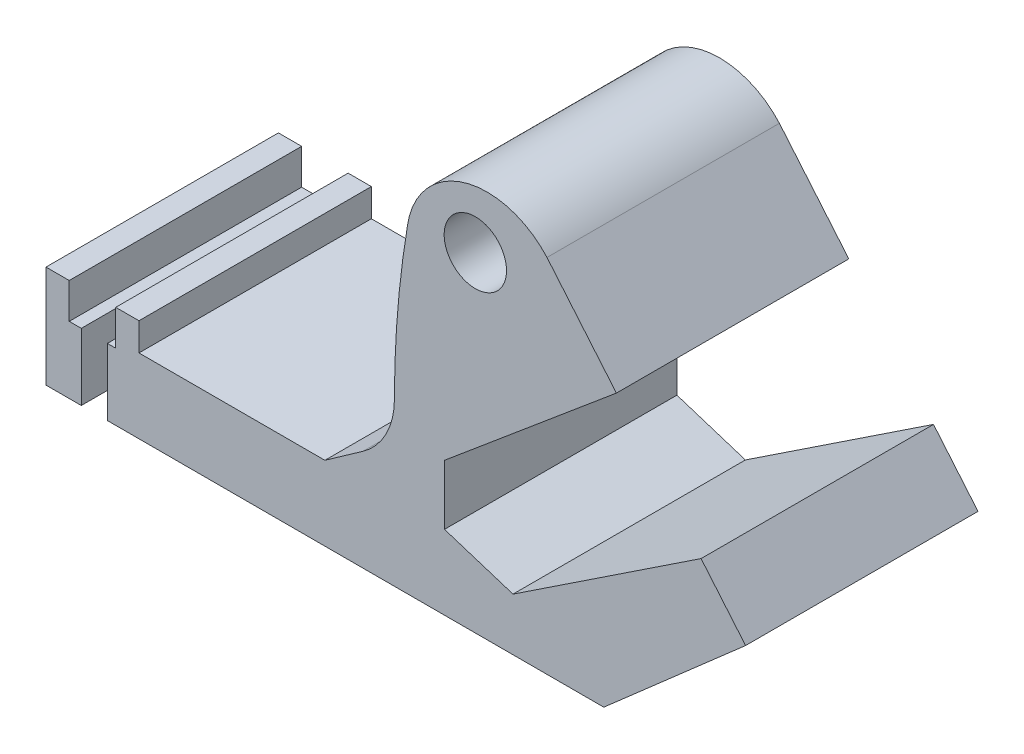
ISO-10303-21;
HEADER;
FILE_DESCRIPTION(('STEP AP214'),'2;1');
FILE_NAME('part.step','',(''),(''),'','','');
FILE_SCHEMA(('AUTOMOTIVE_DESIGN { 1 0 10303 214 1 1 1 1 }'));
ENDSEC;
DATA;
#1=APPLICATION_CONTEXT('core data for automotive mechanical design processes');
#2=APPLICATION_PROTOCOL_DEFINITION('international standard','automotive_design',2000,#1);
#3=PRODUCT_CONTEXT('',#1,'mechanical');
#4=PRODUCT('Part','Part','',(#3));
#5=PRODUCT_RELATED_PRODUCT_CATEGORY('part','',(#4));
#6=PRODUCT_DEFINITION_FORMATION('','',#4);
#7=PRODUCT_DEFINITION_CONTEXT('part definition',#1,'design');
#8=PRODUCT_DEFINITION('design','',#6,#7);
#9=PRODUCT_DEFINITION_SHAPE('','',#8);
#10=(LENGTH_UNIT() NAMED_UNIT(*) SI_UNIT(.MILLI.,.METRE.));
#11=(NAMED_UNIT(*) PLANE_ANGLE_UNIT() SI_UNIT($,.RADIAN.));
#12=(NAMED_UNIT(*) SI_UNIT($,.STERADIAN.) SOLID_ANGLE_UNIT());
#13=UNCERTAINTY_MEASURE_WITH_UNIT(LENGTH_MEASURE(1.E-05),#10,'distance_accuracy_value','');
#14=(GEOMETRIC_REPRESENTATION_CONTEXT(3) GLOBAL_UNCERTAINTY_ASSIGNED_CONTEXT((#13)) GLOBAL_UNIT_ASSIGNED_CONTEXT((#10,
#11,#12)) REPRESENTATION_CONTEXT('',''));
#15=CARTESIAN_POINT('',(0.,0.,0.));
#16=DIRECTION('',(0.,0.,1.));
#17=DIRECTION('',(1.,0.,0.));
#18=AXIS2_PLACEMENT_3D('',#15,#16,#17);
#19=CARTESIAN_POINT('',(0.,14.3835616438356,50.));
#20=DIRECTION('',(0.,1.,0.));
#21=DIRECTION('',(0.,0.,1.));
#22=AXIS2_PLACEMENT_3D('',#19,#20,#21);
#23=PLANE('',#22);
#24=DIRECTION('',(0.,0.,1.));
#25=VECTOR('',#24,1.);
#26=CARTESIAN_POINT('',(-72.5423341715558,14.3835616438356,0.));
#27=LINE('',#26,#25);
#28=CARTESIAN_POINT('',(-72.5423341715558,14.3835616438356,0.));
#29=VERTEX_POINT('',#28);
#30=CARTESIAN_POINT('',(-72.5423341715558,14.3835616438356,50.));
#31=VERTEX_POINT('',#30);
#32=EDGE_CURVE('E54',#29,#31,#27,.T.);
#33=ORIENTED_EDGE('',*,*,#32,.F.);
#34=DIRECTION('',(1.,0.,0.));
#35=VECTOR('',#34,1.);
#36=CARTESIAN_POINT('',(0.,14.3835616438356,0.));
#37=LINE('',#36,#35);
#38=CARTESIAN_POINT('',(-75.1369863013698,14.3835616438356,0.));
#39=VERTEX_POINT('',#38);
#40=EDGE_CURVE('E48',#39,#29,#37,.T.);
#41=ORIENTED_EDGE('',*,*,#40,.F.);
#42=DIRECTION('',(0.,0.,-1.));
#43=VECTOR('',#42,1.);
#44=CARTESIAN_POINT('',(-75.1369863013698,14.3835616438356,50.));
#45=LINE('',#44,#43);
#46=CARTESIAN_POINT('',(-75.1369863013698,14.3835616438356,50.));
#47=VERTEX_POINT('',#46);
#48=EDGE_CURVE('E129',#47,#39,#45,.T.);
#49=ORIENTED_EDGE('',*,*,#48,.F.);
#50=DIRECTION('',(1.,0.,0.));
#51=VECTOR('',#50,1.);
#52=CARTESIAN_POINT('',(0.,14.3835616438356,50.));
#53=LINE('',#52,#51);
#54=EDGE_CURVE('E106',#47,#31,#53,.T.);
#55=ORIENTED_EDGE('',*,*,#54,.T.);
#56=EDGE_LOOP('',(#33,#41,#49,#55));
#57=FACE_BOUND('',#56,.T.);
#58=ADVANCED_FACE('F45',(#57),#23,.T.);
#59=CARTESIAN_POINT('',(0.,0.,50.));
#60=DIRECTION('',(0.,1.,0.));
#61=DIRECTION('',(0.,0.,1.));
#62=AXIS2_PLACEMENT_3D('',#59,#60,#61);
#63=PLANE('',#62);
#64=DIRECTION('',(1.,0.,0.));
#65=VECTOR('',#64,1.);
#66=CARTESIAN_POINT('',(0.,0.,0.));
#67=LINE('',#66,#65);
#68=CARTESIAN_POINT('',(-80.1369863013699,0.,0.));
#69=VERTEX_POINT('',#68);
#70=CARTESIAN_POINT('',(-72.5423341715558,0.,0.));
#71=VERTEX_POINT('',#70);
#72=EDGE_CURVE('E122',#69,#71,#67,.T.);
#73=ORIENTED_EDGE('',*,*,#72,.T.);
#74=DIRECTION('',(0.,0.,1.));
#75=VECTOR('',#74,1.);
#76=CARTESIAN_POINT('',(-72.5423341715558,0.,50.));
#77=LINE('',#76,#75);
#78=CARTESIAN_POINT('',(-72.5423341715558,0.,50.));
#79=VERTEX_POINT('',#78);
#80=EDGE_CURVE('E62',#71,#79,#77,.T.);
#81=ORIENTED_EDGE('',*,*,#80,.T.);
#82=DIRECTION('',(1.,0.,0.));
#83=VECTOR('',#82,1.);
#84=CARTESIAN_POINT('',(0.,0.,50.));
#85=LINE('',#84,#83);
#86=CARTESIAN_POINT('',(-80.1369863013699,0.,50.));
#87=VERTEX_POINT('',#86);
#88=EDGE_CURVE('E113',#87,#79,#85,.T.);
#89=ORIENTED_EDGE('',*,*,#88,.F.);
#90=DIRECTION('',(0.,0.,-1.));
#91=VECTOR('',#90,1.);
#92=CARTESIAN_POINT('',(-80.1369863013699,0.,50.));
#93=LINE('',#92,#91);
#94=EDGE_CURVE('E115',#87,#69,#93,.T.);
#95=ORIENTED_EDGE('',*,*,#94,.T.);
#96=EDGE_LOOP('',(#73,#81,#89,#95));
#97=FACE_BOUND('',#96,.T.);
#98=ADVANCED_FACE('F155',(#97),#63,.F.);
#99=CARTESIAN_POINT('',(0.,0.,50.));
#100=DIRECTION('',(0.,0.,1.));
#101=DIRECTION('',(1.,0.,0.));
#102=AXIS2_PLACEMENT_3D('',#99,#100,#101);
#103=PLANE('',#102);
#104=DIRECTION('',(0.,-1.,0.));
#105=VECTOR('',#104,1.);
#106=CARTESIAN_POINT('',(-72.5423341715558,14.3835616438356,50.));
#107=LINE('',#106,#105);
#108=EDGE_CURVE('E12',#31,#79,#107,.T.);
#109=ORIENTED_EDGE('',*,*,#108,.F.);
#110=ORIENTED_EDGE('',*,*,#54,.F.);
#111=DIRECTION('',(0.,-1.,0.));
#112=VECTOR('',#111,1.);
#113=CARTESIAN_POINT('',(-75.1369863013698,-1.36905874327091E-13,50.));
#114=LINE('',#113,#112);
#115=CARTESIAN_POINT('',(-75.1369863013698,22.,50.));
#116=VERTEX_POINT('',#115);
#117=EDGE_CURVE('E126',#116,#47,#114,.T.);
#118=ORIENTED_EDGE('',*,*,#117,.F.);
#119=DIRECTION('',(1.,0.,0.));
#120=VECTOR('',#119,1.);
#121=CARTESIAN_POINT('',(0.,22.,50.));
#122=LINE('',#121,#120);
#123=CARTESIAN_POINT('',(-80.1369863013699,22.,50.));
#124=VERTEX_POINT('',#123);
#125=EDGE_CURVE('E130',#124,#116,#122,.T.);
#126=ORIENTED_EDGE('',*,*,#125,.F.);
#127=DIRECTION('',(0.,1.,0.));
#128=VECTOR('',#127,1.);
#129=CARTESIAN_POINT('',(-80.1369863013699,0.,50.));
#130=LINE('',#129,#128);
#131=EDGE_CURVE('E134',#87,#124,#130,.T.);
#132=ORIENTED_EDGE('',*,*,#131,.F.);
#133=ORIENTED_EDGE('',*,*,#88,.T.);
#134=EDGE_LOOP('',(#109,#110,#118,#126,#132,#133));
#135=FACE_BOUND('',#134,.T.);
#136=ADVANCED_FACE('F147',(#135),#103,.T.);
#137=CARTESIAN_POINT('',(0.,0.,0.));
#138=DIRECTION('',(0.,0.,1.));
#139=DIRECTION('',(1.,0.,0.));
#140=AXIS2_PLACEMENT_3D('',#137,#138,#139);
#141=PLANE('',#140);
#142=ORIENTED_EDGE('',*,*,#40,.T.);
#143=DIRECTION('',(0.,-1.,0.));
#144=VECTOR('',#143,1.);
#145=CARTESIAN_POINT('',(-72.5423341715558,14.3835616438356,0.));
#146=LINE('',#145,#144);
#147=EDGE_CURVE('E93',#29,#71,#146,.T.);
#148=ORIENTED_EDGE('',*,*,#147,.T.);
#149=ORIENTED_EDGE('',*,*,#72,.F.);
#150=DIRECTION('',(0.,1.,0.));
#151=VECTOR('',#150,1.);
#152=CARTESIAN_POINT('',(-80.1369863013699,0.,0.));
#153=LINE('',#152,#151);
#154=CARTESIAN_POINT('',(-80.1369863013699,22.,0.));
#155=VERTEX_POINT('',#154);
#156=EDGE_CURVE('E99',#69,#155,#153,.T.);
#157=ORIENTED_EDGE('',*,*,#156,.T.);
#158=DIRECTION('',(1.,0.,0.));
#159=VECTOR('',#158,1.);
#160=CARTESIAN_POINT('',(0.,22.,0.));
#161=LINE('',#160,#159);
#162=CARTESIAN_POINT('',(-75.1369863013698,22.,0.));
#163=VERTEX_POINT('',#162);
#164=EDGE_CURVE('E138',#155,#163,#161,.T.);
#165=ORIENTED_EDGE('',*,*,#164,.T.);
#166=DIRECTION('',(0.,-1.,0.));
#167=VECTOR('',#166,1.);
#168=CARTESIAN_POINT('',(-75.1369863013698,-1.36905874327091E-13,0.));
#169=LINE('',#168,#167);
#170=EDGE_CURVE('E112',#163,#39,#169,.T.);
#171=ORIENTED_EDGE('',*,*,#170,.T.);
#172=EDGE_LOOP('',(#142,#148,#149,#157,#165,#171));
#173=FACE_BOUND('',#172,.T.);
#174=ADVANCED_FACE('F109',(#173),#141,.F.);
#175=CARTESIAN_POINT('',(-75.1369863013698,-1.36905874327091E-13,50.));
#176=DIRECTION('',(1.,0.,0.));
#177=DIRECTION('',(0.,1.,0.));
#178=AXIS2_PLACEMENT_3D('',#175,#176,#177);
#179=PLANE('',#178);
#180=ORIENTED_EDGE('',*,*,#170,.F.);
#181=DIRECTION('',(0.,0.,-1.));
#182=VECTOR('',#181,1.);
#183=CARTESIAN_POINT('',(-75.1369863013698,22.,50.));
#184=LINE('',#183,#182);
#185=EDGE_CURVE('E133',#116,#163,#184,.T.);
#186=ORIENTED_EDGE('',*,*,#185,.F.);
#187=ORIENTED_EDGE('',*,*,#117,.T.);
#188=ORIENTED_EDGE('',*,*,#48,.T.);
#189=EDGE_LOOP('',(#180,#186,#187,#188));
#190=FACE_BOUND('',#189,.T.);
#191=ADVANCED_FACE('F145',(#190),#179,.T.);
#192=CARTESIAN_POINT('',(0.,22.,50.));
#193=DIRECTION('',(0.,1.,0.));
#194=DIRECTION('',(0.,0.,1.));
#195=AXIS2_PLACEMENT_3D('',#192,#193,#194);
#196=PLANE('',#195);
#197=ORIENTED_EDGE('',*,*,#164,.F.);
#198=DIRECTION('',(0.,0.,-1.));
#199=VECTOR('',#198,1.);
#200=CARTESIAN_POINT('',(-80.1369863013699,22.,50.));
#201=LINE('',#200,#199);
#202=EDGE_CURVE('E107',#124,#155,#201,.T.);
#203=ORIENTED_EDGE('',*,*,#202,.F.);
#204=ORIENTED_EDGE('',*,*,#125,.T.);
#205=ORIENTED_EDGE('',*,*,#185,.T.);
#206=EDGE_LOOP('',(#197,#203,#204,#205));
#207=FACE_BOUND('',#206,.T.);
#208=ADVANCED_FACE('F151',(#207),#196,.T.);
#209=CARTESIAN_POINT('',(-80.1369863013699,0.,50.));
#210=DIRECTION('',(-1.,0.,0.));
#211=DIRECTION('',(0.,0.,1.));
#212=AXIS2_PLACEMENT_3D('',#209,#210,#211);
#213=PLANE('',#212);
#214=ORIENTED_EDGE('',*,*,#156,.F.);
#215=ORIENTED_EDGE('',*,*,#94,.F.);
#216=ORIENTED_EDGE('',*,*,#131,.T.);
#217=ORIENTED_EDGE('',*,*,#202,.T.);
#218=EDGE_LOOP('',(#214,#215,#216,#217));
#219=FACE_BOUND('',#218,.T.);
#220=ADVANCED_FACE('F154',(#219),#213,.T.);
#221=CARTESIAN_POINT('',(-72.5423341715558,14.3835616438356,0.));
#222=DIRECTION('',(-1.,0.,0.));
#223=DIRECTION('',(0.,0.,1.));
#224=AXIS2_PLACEMENT_3D('',#221,#222,#223);
#225=PLANE('',#224);
#226=ORIENTED_EDGE('',*,*,#147,.F.);
#227=ORIENTED_EDGE('',*,*,#32,.T.);
#228=ORIENTED_EDGE('',*,*,#108,.T.);
#229=ORIENTED_EDGE('',*,*,#80,.F.);
#230=EDGE_LOOP('',(#226,#227,#228,#229));
#231=FACE_BOUND('',#230,.T.);
#232=ADVANCED_FACE('F94',(#231),#225,.F.);
#233=CLOSED_SHELL('',(#58,#98,#136,#174,#191,#208,#220,#232));
#234=MANIFOLD_SOLID_BREP('B2',#233);
#235=CARTESIAN_POINT('',(17.3163557590527,-19.7591991249492,50.));
#236=DIRECTION('',(0.659087667466013,-0.752066118499039,0.));
#237=DIRECTION('',(0.752066118499039,0.659087667466013,0.));
#238=AXIS2_PLACEMENT_3D('',#235,#236,#237);
#239=PLANE('',#238);
#240=DIRECTION('',(-0.752066118499039,-0.659087667466013,0.));
#241=VECTOR('',#240,1.);
#242=CARTESIAN_POINT('',(17.3163557590527,-19.7591991249492,0.));
#243=LINE('',#242,#241);
#244=CARTESIAN_POINT('',(70.3687706515894,26.7343092579921,0.));
#245=VERTEX_POINT('',#244);
#246=CARTESIAN_POINT('',(39.8630136986301,0.,0.));
#247=VERTEX_POINT('',#246);
#248=EDGE_CURVE('E404',#245,#247,#243,.T.);
#249=ORIENTED_EDGE('',*,*,#248,.F.);
#250=DIRECTION('',(0.,0.,-1.));
#251=VECTOR('',#250,1.);
#252=CARTESIAN_POINT('',(70.3687706515894,26.7343092579921,50.));
#253=LINE('',#252,#251);
#254=CARTESIAN_POINT('',(70.3687706515894,26.7343092579921,50.));
#255=VERTEX_POINT('',#254);
#256=EDGE_CURVE('E429',#255,#245,#253,.T.);
#257=ORIENTED_EDGE('',*,*,#256,.F.);
#258=DIRECTION('',(-0.752066118499039,-0.659087667466013,0.));
#259=VECTOR('',#258,1.);
#260=CARTESIAN_POINT('',(17.3163557590527,-19.7591991249492,50.));
#261=LINE('',#260,#259);
#262=CARTESIAN_POINT('',(39.8630136986301,0.,50.));
#263=VERTEX_POINT('',#262);
#264=EDGE_CURVE('E490',#255,#263,#261,.T.);
#265=ORIENTED_EDGE('',*,*,#264,.T.);
#266=DIRECTION('',(0.,0.,-1.));
#267=VECTOR('',#266,1.);
#268=CARTESIAN_POINT('',(39.8630136986301,0.,50.));
#269=LINE('',#268,#267);
#270=EDGE_CURVE('E431',#263,#247,#269,.T.);
#271=ORIENTED_EDGE('',*,*,#270,.T.);
#272=EDGE_LOOP('',(#249,#257,#265,#271));
#273=FACE_BOUND('',#272,.T.);
#274=ADVANCED_FACE('F221',(#273),#239,.T.);
#275=CARTESIAN_POINT('',(54.4784531641883,45.6837252991175,50.));
#276=DIRECTION('',(0.766246114652331,0.642547190313838,0.));
#277=DIRECTION('',(-0.642547190313838,0.766246114652331,0.));
#278=AXIS2_PLACEMENT_3D('',#275,#276,#277);
#279=PLANE('',#278);
#280=DIRECTION('',(0.642547190313838,-0.766246114652331,0.));
#281=VECTOR('',#280,1.);
#282=CARTESIAN_POINT('',(54.4784531641883,45.6837252991175,0.));
#283=LINE('',#282,#281);
#284=CARTESIAN_POINT('',(60.7931169667828,38.1534042938845,0.));
#285=VERTEX_POINT('',#284);
#286=EDGE_CURVE('E407',#285,#245,#283,.T.);
#287=ORIENTED_EDGE('',*,*,#286,.F.);
#288=DIRECTION('',(0.,0.,-1.));
#289=VECTOR('',#288,1.);
#290=CARTESIAN_POINT('',(60.7931169667828,38.1534042938845,50.));
#291=LINE('',#290,#289);
#292=CARTESIAN_POINT('',(60.7931169667828,38.1534042938845,50.));
#293=VERTEX_POINT('',#292);
#294=EDGE_CURVE('E427',#293,#285,#291,.T.);
#295=ORIENTED_EDGE('',*,*,#294,.F.);
#296=DIRECTION('',(0.642547190313838,-0.766246114652331,0.));
#297=VECTOR('',#296,1.);
#298=CARTESIAN_POINT('',(54.4784531641883,45.6837252991175,50.));
#299=LINE('',#298,#297);
#300=EDGE_CURVE('E493',#293,#255,#299,.T.);
#301=ORIENTED_EDGE('',*,*,#300,.T.);
#302=ORIENTED_EDGE('',*,*,#256,.T.);
#303=EDGE_LOOP('',(#287,#295,#301,#302));
#304=FACE_BOUND('',#303,.T.);
#305=ADVANCED_FACE('F513',(#304),#279,.T.);
#306=CARTESIAN_POINT('',(1.01087400947676,-1.52312504740375,50.));
#307=DIRECTION('',(-0.552978634171134,0.83319543334696,0.));
#308=DIRECTION('',(-0.83319543334696,-0.552978634171134,0.));
#309=AXIS2_PLACEMENT_3D('',#306,#307,#308);
#310=PLANE('',#309);
#311=DIRECTION('',(0.83319543334696,0.552978634171134,0.));
#312=VECTOR('',#311,1.);
#313=CARTESIAN_POINT('',(1.01087400947676,-1.52312504740375,0.));
#314=LINE('',#313,#312);
#315=CARTESIAN_POINT('',(20.3290796564426,11.2980625704691,0.));
#316=VERTEX_POINT('',#315);
#317=EDGE_CURVE('E410',#316,#285,#314,.T.);
#318=ORIENTED_EDGE('',*,*,#317,.F.);
#319=DIRECTION('',(0.,0.,-1.));
#320=VECTOR('',#319,1.);
#321=CARTESIAN_POINT('',(20.3290796564426,11.2980625704691,50.));
#322=LINE('',#321,#320);
#323=CARTESIAN_POINT('',(20.3290796564426,11.2980625704691,50.));
#324=VERTEX_POINT('',#323);
#325=EDGE_CURVE('E425',#324,#316,#322,.T.);
#326=ORIENTED_EDGE('',*,*,#325,.F.);
#327=DIRECTION('',(0.83319543334696,0.552978634171134,0.));
#328=VECTOR('',#327,1.);
#329=CARTESIAN_POINT('',(1.01087400947676,-1.52312504740375,50.));
#330=LINE('',#329,#328);
#331=EDGE_CURVE('E496',#324,#293,#330,.T.);
#332=ORIENTED_EDGE('',*,*,#331,.T.);
#333=ORIENTED_EDGE('',*,*,#294,.T.);
#334=EDGE_LOOP('',(#318,#326,#332,#333));
#335=FACE_BOUND('',#334,.T.);
#336=ADVANCED_FACE('F519',(#335),#310,.T.);
#337=CARTESIAN_POINT('',(5.15190942794175,16.1420270848739,50.));
#338=DIRECTION('',(0.304050814105741,0.95265581530878,0.));
#339=DIRECTION('',(-0.95265581530878,0.304050814105741,0.));
#340=AXIS2_PLACEMENT_3D('',#337,#338,#339);
#341=PLANE('',#340);
#342=DIRECTION('',(0.95265581530878,-0.304050814105741,0.));
#343=VECTOR('',#342,1.);
#344=CARTESIAN_POINT('',(5.15190942794175,16.1420270848739,0.));
#345=LINE('',#344,#343);
#346=CARTESIAN_POINT('',(5.59691046743721,16.,0.));
#347=VERTEX_POINT('',#346);
#348=EDGE_CURVE('E413',#347,#316,#345,.T.);
#349=ORIENTED_EDGE('',*,*,#348,.F.);
#350=DIRECTION('',(0.,0.,-1.));
#351=VECTOR('',#350,1.);
#352=CARTESIAN_POINT('',(5.59691046743721,16.,50.));
#353=LINE('',#352,#351);
#354=CARTESIAN_POINT('',(5.59691046743721,16.,50.));
#355=VERTEX_POINT('',#354);
#356=EDGE_CURVE('E358',#355,#347,#353,.T.);
#357=ORIENTED_EDGE('',*,*,#356,.F.);
#358=DIRECTION('',(0.95265581530878,-0.304050814105741,0.));
#359=VECTOR('',#358,1.);
#360=CARTESIAN_POINT('',(5.15190942794175,16.1420270848739,50.));
#361=LINE('',#360,#359);
#362=EDGE_CURVE('E368',#355,#324,#361,.T.);
#363=ORIENTED_EDGE('',*,*,#362,.T.);
#364=ORIENTED_EDGE('',*,*,#325,.T.);
#365=EDGE_LOOP('',(#349,#357,#363,#364));
#366=FACE_BOUND('',#365,.T.);
#367=ADVANCED_FACE('F500',(#366),#341,.T.);
#368=CARTESIAN_POINT('',(5.59691046743721,0.,50.));
#369=DIRECTION('',(1.,0.,0.));
#370=DIRECTION('',(0.,0.,-1.));
#371=AXIS2_PLACEMENT_3D('',#368,#369,#370);
#372=PLANE('',#371);
#373=DIRECTION('',(0.,-1.,0.));
#374=VECTOR('',#373,1.);
#375=CARTESIAN_POINT('',(5.59691046743721,0.,0.));
#376=LINE('',#375,#374);
#377=CARTESIAN_POINT('',(5.59691046743721,28.8663712824916,0.));
#378=VERTEX_POINT('',#377);
#379=EDGE_CURVE('E353',#378,#347,#376,.T.);
#380=ORIENTED_EDGE('',*,*,#379,.F.);
#381=DIRECTION('',(0.,0.,-1.));
#382=VECTOR('',#381,1.);
#383=CARTESIAN_POINT('',(5.59691046743721,28.8663712824916,50.));
#384=LINE('',#383,#382);
#385=CARTESIAN_POINT('',(5.59691046743721,28.8663712824916,50.));
#386=VERTEX_POINT('',#385);
#387=EDGE_CURVE('E348',#386,#378,#384,.T.);
#388=ORIENTED_EDGE('',*,*,#387,.F.);
#389=DIRECTION('',(0.,-1.,0.));
#390=VECTOR('',#389,1.);
#391=CARTESIAN_POINT('',(5.59691046743721,0.,50.));
#392=LINE('',#391,#390);
#393=EDGE_CURVE('E351',#386,#355,#392,.T.);
#394=ORIENTED_EDGE('',*,*,#393,.T.);
#395=ORIENTED_EDGE('',*,*,#356,.T.);
#396=EDGE_LOOP('',(#380,#388,#394,#395));
#397=FACE_BOUND('',#396,.T.);
#398=ADVANCED_FACE('F350',(#397),#372,.T.);
#399=CARTESIAN_POINT('',(-11.9015583215114,14.1927674101446,50.));
#400=DIRECTION('',(0.642547190313838,-0.766246114652331,0.));
#401=DIRECTION('',(0.766246114652331,0.642547190313838,0.));
#402=AXIS2_PLACEMENT_3D('',#399,#400,#401);
#403=PLANE('',#402);
#404=DIRECTION('',(-0.766246114652331,-0.642547190313838,0.));
#405=VECTOR('',#404,1.);
#406=CARTESIAN_POINT('',(-11.9015583215114,14.1927674101446,0.));
#407=LINE('',#406,#405);
#408=CARTESIAN_POINT('',(42.5768948426769,59.8764927092621,0.));
#409=VERTEX_POINT('',#408);
#410=EDGE_CURVE('E417',#409,#378,#407,.T.);
#411=ORIENTED_EDGE('',*,*,#410,.F.);
#412=DIRECTION('',(0.,0.,-1.));
#413=VECTOR('',#412,1.);
#414=CARTESIAN_POINT('',(42.5768948426769,59.8764927092621,50.));
#415=LINE('',#414,#413);
#416=CARTESIAN_POINT('',(42.5768948426769,59.8764927092621,50.));
#417=VERTEX_POINT('',#416);
#418=EDGE_CURVE('E359',#417,#409,#415,.T.);
#419=ORIENTED_EDGE('',*,*,#418,.F.);
#420=DIRECTION('',(-0.766246114652331,-0.642547190313838,0.));
#421=VECTOR('',#420,1.);
#422=CARTESIAN_POINT('',(-11.9015583215114,14.1927674101446,50.));
#423=LINE('',#422,#421);
#424=EDGE_CURVE('E365',#417,#386,#423,.T.);
#425=ORIENTED_EDGE('',*,*,#424,.T.);
#426=ORIENTED_EDGE('',*,*,#387,.T.);
#427=EDGE_LOOP('',(#411,#419,#425,#426));
#428=FACE_BOUND('',#427,.T.);
#429=ADVANCED_FACE('F370',(#428),#403,.T.);
#430=CARTESIAN_POINT('',(54.4784531641883,45.6837252991175,50.));
#431=DIRECTION('',(-0.766246114652331,-0.642547190313838,0.));
#432=DIRECTION('',(0.642547190313838,-0.766246114652331,0.));
#433=AXIS2_PLACEMENT_3D('',#430,#431,#432);
#434=PLANE('',#433);
#435=DIRECTION('',(-0.642547190313838,0.766246114652331,0.));
#436=VECTOR('',#435,1.);
#437=CARTESIAN_POINT('',(54.4784531641883,45.6837252991175,0.));
#438=LINE('',#437,#436);
#439=CARTESIAN_POINT('',(27.6444487989831,77.6836342479986,0.));
#440=VERTEX_POINT('',#439);
#441=EDGE_CURVE('E419',#409,#440,#438,.T.);
#442=ORIENTED_EDGE('',*,*,#441,.T.);
#443=DIRECTION('',(0.,0.,-1.));
#444=VECTOR('',#443,1.);
#445=CARTESIAN_POINT('',(27.6444487989831,77.6836342479986,50.));
#446=LINE('',#445,#444);
#447=CARTESIAN_POINT('',(27.6444487989831,77.6836342479986,50.));
#448=VERTEX_POINT('',#447);
#449=EDGE_CURVE('E302',#448,#440,#446,.T.);
#450=ORIENTED_EDGE('',*,*,#449,.F.);
#451=DIRECTION('',(-0.642547190313838,0.766246114652331,0.));
#452=VECTOR('',#451,1.);
#453=CARTESIAN_POINT('',(54.4784531641883,45.6837252991175,50.));
#454=LINE('',#453,#452);
#455=EDGE_CURVE('E244',#417,#448,#454,.T.);
#456=ORIENTED_EDGE('',*,*,#455,.F.);
#457=ORIENTED_EDGE('',*,*,#418,.T.);
#458=EDGE_LOOP('',(#442,#450,#456,#457));
#459=FACE_BOUND('',#458,.T.);
#460=ADVANCED_FACE('F503',(#459),#434,.F.);
#461=CARTESIAN_POINT('',(14.7563529170029,66.1350942319864,50.));
#462=DIRECTION('',(0.,0.,-1.));
#463=DIRECTION('',(-1.,0.,0.));
#464=AXIS2_PLACEMENT_3D('',#461,#462,#463);
#465=CYLINDRICAL_SURFACE('',#464,17.3052533054142);
#466=CARTESIAN_POINT('',(14.7563529170029,66.1350942319864,0.));
#467=DIRECTION('',(0.,0.,1.));
#468=DIRECTION('',(1.,0.,0.));
#469=AXIS2_PLACEMENT_3D('',#466,#467,#468);
#470=CIRCLE('',#469,17.3052533054142);
#471=CARTESIAN_POINT('',(-2.36290679718831,68.6654576056192,0.));
#472=VERTEX_POINT('',#471);
#473=EDGE_CURVE('E375',#472,#440,#470,.F.);
#474=ORIENTED_EDGE('',*,*,#473,.F.);
#475=DIRECTION('',(0.,0.,-1.));
#476=VECTOR('',#475,1.);
#477=CARTESIAN_POINT('',(-2.36290679718831,68.6654576056192,50.));
#478=LINE('',#477,#476);
#479=CARTESIAN_POINT('',(-2.36290679718831,68.6654576056192,50.));
#480=VERTEX_POINT('',#479);
#481=EDGE_CURVE('E229',#480,#472,#478,.T.);
#482=ORIENTED_EDGE('',*,*,#481,.F.);
#483=CARTESIAN_POINT('',(14.7563529170029,66.1350942319864,50.));
#484=DIRECTION('',(0.,0.,1.));
#485=DIRECTION('',(1.,0.,0.));
#486=AXIS2_PLACEMENT_3D('',#483,#484,#485);
#487=CIRCLE('',#486,17.3052533054142);
#488=EDGE_CURVE('E421',#480,#448,#487,.F.);
#489=ORIENTED_EDGE('',*,*,#488,.T.);
#490=ORIENTED_EDGE('',*,*,#449,.T.);
#491=EDGE_LOOP('',(#474,#482,#489,#490));
#492=FACE_BOUND('',#491,.T.);
#493=ADVANCED_FACE('F223',(#492),#465,.T.);
#494=CARTESIAN_POINT('',(199.248636721827,34.8390611038076,50.));
#495=DIRECTION('',(0.,0.,-1.));
#496=DIRECTION('',(-1.,0.,0.));
#497=AXIS2_PLACEMENT_3D('',#494,#495,#496);
#498=CYLINDRICAL_SURFACE('',#497,204.429546740234);
#499=CARTESIAN_POINT('',(199.248636721827,34.8390611038076,0.));
#500=DIRECTION('',(0.,0.,1.));
#501=DIRECTION('',(1.,0.,0.));
#502=AXIS2_PLACEMENT_3D('',#499,#500,#501);
#503=CIRCLE('',#502,204.429546740234);
#504=CARTESIAN_POINT('',(-5.18091001840715,34.8390611038079,0.));
#505=VERTEX_POINT('',#504);
#506=EDGE_CURVE('E378',#505,#472,#503,.F.);
#507=ORIENTED_EDGE('',*,*,#506,.F.);
#508=DIRECTION('',(0.,0.,-1.));
#509=VECTOR('',#508,1.);
#510=CARTESIAN_POINT('',(-5.18091001840715,34.8390611038079,50.));
#511=LINE('',#510,#509);
#512=CARTESIAN_POINT('',(-5.18091001840715,34.8390611038079,50.));
#513=VERTEX_POINT('',#512);
#514=EDGE_CURVE('E447',#513,#505,#511,.T.);
#515=ORIENTED_EDGE('',*,*,#514,.F.);
#516=CARTESIAN_POINT('',(199.248636721827,34.8390611038076,50.));
#517=DIRECTION('',(0.,0.,1.));
#518=DIRECTION('',(1.,0.,0.));
#519=AXIS2_PLACEMENT_3D('',#516,#517,#518);
#520=CIRCLE('',#519,204.429546740234);
#521=EDGE_CURVE('E453',#513,#480,#520,.F.);
#522=ORIENTED_EDGE('',*,*,#521,.T.);
#523=ORIENTED_EDGE('',*,*,#481,.T.);
#524=EDGE_LOOP('',(#507,#515,#522,#523));
#525=FACE_BOUND('',#524,.T.);
#526=ADVANCED_FACE('F451',(#525),#498,.T.);
#527=CARTESIAN_POINT('',(-21.1809100184071,34.8390611038079,50.));
#528=DIRECTION('',(0.,0.,-1.));
#529=DIRECTION('',(-1.,0.,0.));
#530=AXIS2_PLACEMENT_3D('',#527,#528,#529);
#531=CYLINDRICAL_SURFACE('',#530,16.);
#532=CARTESIAN_POINT('',(-21.1809100184071,34.8390611038079,0.));
#533=DIRECTION('',(0.,0.,1.));
#534=DIRECTION('',(1.,0.,0.));
#535=AXIS2_PLACEMENT_3D('',#532,#533,#534);
#536=CIRCLE('',#535,16.);
#537=CARTESIAN_POINT('',(-11.9632295460172,21.7610502952437,0.));
#538=VERTEX_POINT('',#537);
#539=EDGE_CURVE('E382',#538,#505,#536,.T.);
#540=ORIENTED_EDGE('',*,*,#539,.F.);
#541=DIRECTION('',(0.,0.,-1.));
#542=VECTOR('',#541,1.);
#543=CARTESIAN_POINT('',(-11.9632295460172,21.7610502952437,50.));
#544=LINE('',#543,#542);
#545=CARTESIAN_POINT('',(-11.9632295460172,21.7610502952437,50.));
#546=VERTEX_POINT('',#545);
#547=EDGE_CURVE('E445',#546,#538,#544,.T.);
#548=ORIENTED_EDGE('',*,*,#547,.F.);
#549=CARTESIAN_POINT('',(-21.1809100184071,34.8390611038079,50.));
#550=DIRECTION('',(0.,0.,1.));
#551=DIRECTION('',(1.,0.,0.));
#552=AXIS2_PLACEMENT_3D('',#549,#550,#551);
#553=CIRCLE('',#552,16.);
#554=EDGE_CURVE('E464',#546,#513,#553,.T.);
#555=ORIENTED_EDGE('',*,*,#554,.T.);
#556=ORIENTED_EDGE('',*,*,#514,.T.);
#557=EDGE_LOOP('',(#540,#548,#555,#556));
#558=FACE_BOUND('',#557,.T.);
#559=ADVANCED_FACE('F461',(#558),#531,.F.);
#560=CARTESIAN_POINT('',(-14.21771324701,20.1720387329996,50.));
#561=DIRECTION('',(-0.576105029524369,0.817375675535262,0.));
#562=DIRECTION('',(-0.817375675535262,-0.576105029524369,0.));
#563=AXIS2_PLACEMENT_3D('',#560,#561,#562);
#564=PLANE('',#563);
#565=DIRECTION('',(0.817375675535262,0.576105029524369,0.));
#566=VECTOR('',#565,1.);
#567=CARTESIAN_POINT('',(-14.21771324701,20.1720387329996,0.));
#568=LINE('',#567,#566);
#569=CARTESIAN_POINT('',(-20.1369863013699,16.,0.));
#570=VERTEX_POINT('',#569);
#571=EDGE_CURVE('E385',#570,#538,#568,.T.);
#572=ORIENTED_EDGE('',*,*,#571,.F.);
#573=DIRECTION('',(0.,0.,-1.));
#574=VECTOR('',#573,1.);
#575=CARTESIAN_POINT('',(-20.1369863013699,16.,50.));
#576=LINE('',#575,#574);
#577=CARTESIAN_POINT('',(-20.1369863013699,16.,50.));
#578=VERTEX_POINT('',#577);
#579=EDGE_CURVE('E443',#578,#570,#576,.T.);
#580=ORIENTED_EDGE('',*,*,#579,.F.);
#581=DIRECTION('',(0.817375675535262,0.576105029524369,0.));
#582=VECTOR('',#581,1.);
#583=CARTESIAN_POINT('',(-14.21771324701,20.1720387329996,50.));
#584=LINE('',#583,#582);
#585=EDGE_CURVE('E468',#578,#546,#584,.T.);
#586=ORIENTED_EDGE('',*,*,#585,.T.);
#587=ORIENTED_EDGE('',*,*,#547,.T.);
#588=EDGE_LOOP('',(#572,#580,#586,#587));
#589=FACE_BOUND('',#588,.T.);
#590=ADVANCED_FACE('F550',(#589),#564,.T.);
#591=CARTESIAN_POINT('',(0.,16.,50.));
#592=DIRECTION('',(0.,1.,0.));
#593=DIRECTION('',(0.,0.,1.));
#594=AXIS2_PLACEMENT_3D('',#591,#592,#593);
#595=PLANE('',#594);
#596=DIRECTION('',(1.,0.,0.));
#597=VECTOR('',#596,1.);
#598=CARTESIAN_POINT('',(0.,16.,0.));
#599=LINE('',#598,#597);
#600=CARTESIAN_POINT('',(-60.1369863013699,16.,0.));
#601=VERTEX_POINT('',#600);
#602=EDGE_CURVE('E388',#601,#570,#599,.T.);
#603=ORIENTED_EDGE('',*,*,#602,.F.);
#604=DIRECTION('',(0.,0.,-1.));
#605=VECTOR('',#604,1.);
#606=CARTESIAN_POINT('',(-60.1369863013699,16.,50.));
#607=LINE('',#606,#605);
#608=CARTESIAN_POINT('',(-60.1369863013699,16.,50.));
#609=VERTEX_POINT('',#608);
#610=EDGE_CURVE('E441',#609,#601,#607,.T.);
#611=ORIENTED_EDGE('',*,*,#610,.F.);
#612=DIRECTION('',(1.,0.,0.));
#613=VECTOR('',#612,1.);
#614=CARTESIAN_POINT('',(0.,16.,50.));
#615=LINE('',#614,#613);
#616=EDGE_CURVE('E474',#609,#578,#615,.T.);
#617=ORIENTED_EDGE('',*,*,#616,.T.);
#618=ORIENTED_EDGE('',*,*,#579,.T.);
#619=EDGE_LOOP('',(#603,#611,#617,#618));
#620=FACE_BOUND('',#619,.T.);
#621=ADVANCED_FACE('F546',(#620),#595,.T.);
#622=CARTESIAN_POINT('',(-60.1369863013699,0.,50.));
#623=DIRECTION('',(1.,0.,0.));
#624=DIRECTION('',(0.,0.,-1.));
#625=AXIS2_PLACEMENT_3D('',#622,#623,#624);
#626=PLANE('',#625);
#627=DIRECTION('',(0.,-1.,0.));
#628=VECTOR('',#627,1.);
#629=CARTESIAN_POINT('',(-60.1369863013699,0.,0.));
#630=LINE('',#629,#628);
#631=CARTESIAN_POINT('',(-60.1369863013699,22.,0.));
#632=VERTEX_POINT('',#631);
#633=EDGE_CURVE('E391',#632,#601,#630,.T.);
#634=ORIENTED_EDGE('',*,*,#633,.F.);
#635=DIRECTION('',(0.,0.,-1.));
#636=VECTOR('',#635,1.);
#637=CARTESIAN_POINT('',(-60.1369863013699,22.,50.));
#638=LINE('',#637,#636);
#639=CARTESIAN_POINT('',(-60.1369863013699,22.,50.));
#640=VERTEX_POINT('',#639);
#641=EDGE_CURVE('E439',#640,#632,#638,.T.);
#642=ORIENTED_EDGE('',*,*,#641,.F.);
#643=DIRECTION('',(0.,-1.,0.));
#644=VECTOR('',#643,1.);
#645=CARTESIAN_POINT('',(-60.1369863013699,0.,50.));
#646=LINE('',#645,#644);
#647=EDGE_CURVE('E477',#640,#609,#646,.T.);
#648=ORIENTED_EDGE('',*,*,#647,.T.);
#649=ORIENTED_EDGE('',*,*,#610,.T.);
#650=EDGE_LOOP('',(#634,#642,#648,#649));
#651=FACE_BOUND('',#650,.T.);
#652=ADVANCED_FACE('F542',(#651),#626,.T.);
#653=CARTESIAN_POINT('',(0.,22.,50.));
#654=DIRECTION('',(0.,1.,0.));
#655=DIRECTION('',(0.,0.,1.));
#656=AXIS2_PLACEMENT_3D('',#653,#654,#655);
#657=PLANE('',#656);
#658=DIRECTION('',(1.,0.,0.));
#659=VECTOR('',#658,1.);
#660=CARTESIAN_POINT('',(0.,22.,0.));
#661=LINE('',#660,#659);
#662=CARTESIAN_POINT('',(-65.1369863013699,22.,0.));
#663=VERTEX_POINT('',#662);
#664=EDGE_CURVE('E394',#663,#632,#661,.T.);
#665=ORIENTED_EDGE('',*,*,#664,.F.);
#666=DIRECTION('',(0.,0.,-1.));
#667=VECTOR('',#666,1.);
#668=CARTESIAN_POINT('',(-65.1369863013699,22.,50.));
#669=LINE('',#668,#667);
#670=CARTESIAN_POINT('',(-65.1369863013699,22.,50.));
#671=VERTEX_POINT('',#670);
#672=EDGE_CURVE('E437',#671,#663,#669,.T.);
#673=ORIENTED_EDGE('',*,*,#672,.F.);
#674=DIRECTION('',(1.,0.,0.));
#675=VECTOR('',#674,1.);
#676=CARTESIAN_POINT('',(0.,22.,50.));
#677=LINE('',#676,#675);
#678=EDGE_CURVE('E480',#671,#640,#677,.T.);
#679=ORIENTED_EDGE('',*,*,#678,.T.);
#680=ORIENTED_EDGE('',*,*,#641,.T.);
#681=EDGE_LOOP('',(#665,#673,#679,#680));
#682=FACE_BOUND('',#681,.T.);
#683=ADVANCED_FACE('F538',(#682),#657,.T.);
#684=CARTESIAN_POINT('',(-65.1369863013699,0.,50.));
#685=DIRECTION('',(-1.,0.,0.));
#686=DIRECTION('',(0.,0.,1.));
#687=AXIS2_PLACEMENT_3D('',#684,#685,#686);
#688=PLANE('',#687);
#689=DIRECTION('',(0.,1.,0.));
#690=VECTOR('',#689,1.);
#691=CARTESIAN_POINT('',(-65.1369863013699,0.,0.));
#692=LINE('',#691,#690);
#693=CARTESIAN_POINT('',(-65.1369863013699,14.3835616438356,0.));
#694=VERTEX_POINT('',#693);
#695=EDGE_CURVE('E397',#694,#663,#692,.T.);
#696=ORIENTED_EDGE('',*,*,#695,.F.);
#697=DIRECTION('',(0.,0.,-1.));
#698=VECTOR('',#697,1.);
#699=CARTESIAN_POINT('',(-65.1369863013699,14.3835616438356,50.));
#700=LINE('',#699,#698);
#701=CARTESIAN_POINT('',(-65.1369863013699,14.3835616438356,50.));
#702=VERTEX_POINT('',#701);
#703=EDGE_CURVE('E434',#702,#694,#700,.T.);
#704=ORIENTED_EDGE('',*,*,#703,.F.);
#705=DIRECTION('',(0.,1.,0.));
#706=VECTOR('',#705,1.);
#707=CARTESIAN_POINT('',(-65.1369863013699,0.,50.));
#708=LINE('',#707,#706);
#709=EDGE_CURVE('E483',#702,#671,#708,.T.);
#710=ORIENTED_EDGE('',*,*,#709,.T.);
#711=ORIENTED_EDGE('',*,*,#672,.T.);
#712=EDGE_LOOP('',(#696,#704,#710,#711));
#713=FACE_BOUND('',#712,.T.);
#714=ADVANCED_FACE('F534',(#713),#688,.T.);
#715=CARTESIAN_POINT('',(12.2310166264402,70.8693700998726,0.));
#716=DIRECTION('',(0.,0.,1.));
#717=DIRECTION('',(1.,0.,0.));
#718=AXIS2_PLACEMENT_3D('',#715,#716,#717);
#719=CYLINDRICAL_SURFACE('',#718,6.70695527321682);
#720=CARTESIAN_POINT('',(12.2310166264402,70.8693700998726,0.));
#721=DIRECTION('',(0.,0.,1.));
#722=DIRECTION('',(1.,0.,0.));
#723=AXIS2_PLACEMENT_3D('',#720,#721,#722);
#724=CIRCLE('',#723,6.70695527321682);
#725=CARTESIAN_POINT('',(18.937971899657,70.8693700998726,0.));
#726=VERTEX_POINT('',#725);
#727=EDGE_CURVE('E379',#726,#726,#724,.T.);
#728=ORIENTED_EDGE('',*,*,#727,.F.);
#729=EDGE_LOOP('',(#728));
#730=FACE_BOUND('',#729,.T.);
#731=CARTESIAN_POINT('',(12.2310166264402,70.8693700998726,50.));
#732=DIRECTION('',(0.,0.,1.));
#733=DIRECTION('',(1.,0.,0.));
#734=AXIS2_PLACEMENT_3D('',#731,#732,#733);
#735=CIRCLE('',#734,6.70695527321682);
#736=CARTESIAN_POINT('',(18.937971899657,70.8693700998726,50.));
#737=VERTEX_POINT('',#736);
#738=EDGE_CURVE('E719',#737,#737,#735,.T.);
#739=ORIENTED_EDGE('',*,*,#738,.T.);
#740=EDGE_LOOP('',(#739));
#741=FACE_BOUND('',#740,.T.);
#742=ADVANCED_FACE('F537',(#730,#741),#719,.F.);
#743=CARTESIAN_POINT('',(0.,0.,0.));
#744=DIRECTION('',(0.,0.,1.));
#745=DIRECTION('',(1.,0.,0.));
#746=AXIS2_PLACEMENT_3D('',#743,#744,#745);
#747=PLANE('',#746);
#748=ORIENTED_EDGE('',*,*,#727,.T.);
#749=EDGE_LOOP('',(#748));
#750=FACE_BOUND('',#749,.T.);
#751=DIRECTION('',(1.,0.,0.));
#752=VECTOR('',#751,1.);
#753=CARTESIAN_POINT('',(0.,0.,0.));
#754=LINE('',#753,#752);
#755=CARTESIAN_POINT('',(-66.926433960963,0.,0.));
#756=VERTEX_POINT('',#755);
#757=EDGE_CURVE('E402',#756,#247,#754,.T.);
#758=ORIENTED_EDGE('',*,*,#757,.F.);
#759=DIRECTION('',(0.,1.,0.));
#760=VECTOR('',#759,1.);
#761=CARTESIAN_POINT('',(-66.926433960963,0.,0.));
#762=LINE('',#761,#760);
#763=CARTESIAN_POINT('',(-66.926433960963,14.3835616438356,0.));
#764=VERTEX_POINT('',#763);
#765=EDGE_CURVE('E43',#756,#764,#762,.T.);
#766=ORIENTED_EDGE('',*,*,#765,.T.);
#767=DIRECTION('',(1.,0.,0.));
#768=VECTOR('',#767,1.);
#769=CARTESIAN_POINT('',(0.,14.3835616438356,0.));
#770=LINE('',#769,#768);
#771=EDGE_CURVE('E400',#764,#694,#770,.T.);
#772=ORIENTED_EDGE('',*,*,#771,.T.);
#773=ORIENTED_EDGE('',*,*,#695,.T.);
#774=ORIENTED_EDGE('',*,*,#664,.T.);
#775=ORIENTED_EDGE('',*,*,#633,.T.);
#776=ORIENTED_EDGE('',*,*,#602,.T.);
#777=ORIENTED_EDGE('',*,*,#571,.T.);
#778=ORIENTED_EDGE('',*,*,#539,.T.);
#779=ORIENTED_EDGE('',*,*,#506,.T.);
#780=ORIENTED_EDGE('',*,*,#473,.T.);
#781=ORIENTED_EDGE('',*,*,#441,.F.);
#782=ORIENTED_EDGE('',*,*,#410,.T.);
#783=ORIENTED_EDGE('',*,*,#379,.T.);
#784=ORIENTED_EDGE('',*,*,#348,.T.);
#785=ORIENTED_EDGE('',*,*,#317,.T.);
#786=ORIENTED_EDGE('',*,*,#286,.T.);
#787=ORIENTED_EDGE('',*,*,#248,.T.);
#788=EDGE_LOOP('',(#758,#766,#772,#773,#774,#775,#776,#777,#778,#779,#780,#781,#782,#783,#784,
#785,#786,#787));
#789=FACE_BOUND('',#788,.T.);
#790=ADVANCED_FACE('F457',(#750,#789),#747,.F.);
#791=CARTESIAN_POINT('',(0.,0.,50.));
#792=DIRECTION('',(0.,0.,1.));
#793=DIRECTION('',(1.,0.,0.));
#794=AXIS2_PLACEMENT_3D('',#791,#792,#793);
#795=PLANE('',#794);
#796=DIRECTION('',(0.,1.,0.));
#797=VECTOR('',#796,1.);
#798=CARTESIAN_POINT('',(-66.926433960963,14.3835616438356,50.));
#799=LINE('',#798,#797);
#800=CARTESIAN_POINT('',(-66.926433960963,0.,50.));
#801=VERTEX_POINT('',#800);
#802=CARTESIAN_POINT('',(-66.926433960963,14.3835616438356,50.));
#803=VERTEX_POINT('',#802);
#804=EDGE_CURVE('E706',#801,#803,#799,.T.);
#805=ORIENTED_EDGE('',*,*,#804,.F.);
#806=DIRECTION('',(1.,0.,0.));
#807=VECTOR('',#806,1.);
#808=CARTESIAN_POINT('',(0.,0.,50.));
#809=LINE('',#808,#807);
#810=EDGE_CURVE('E488',#801,#263,#809,.T.);
#811=ORIENTED_EDGE('',*,*,#810,.T.);
#812=ORIENTED_EDGE('',*,*,#264,.F.);
#813=ORIENTED_EDGE('',*,*,#300,.F.);
#814=ORIENTED_EDGE('',*,*,#331,.F.);
#815=ORIENTED_EDGE('',*,*,#362,.F.);
#816=ORIENTED_EDGE('',*,*,#393,.F.);
#817=ORIENTED_EDGE('',*,*,#424,.F.);
#818=ORIENTED_EDGE('',*,*,#455,.T.);
#819=ORIENTED_EDGE('',*,*,#488,.F.);
#820=ORIENTED_EDGE('',*,*,#521,.F.);
#821=ORIENTED_EDGE('',*,*,#554,.F.);
#822=ORIENTED_EDGE('',*,*,#585,.F.);
#823=ORIENTED_EDGE('',*,*,#616,.F.);
#824=ORIENTED_EDGE('',*,*,#647,.F.);
#825=ORIENTED_EDGE('',*,*,#678,.F.);
#826=ORIENTED_EDGE('',*,*,#709,.F.);
#827=DIRECTION('',(1.,0.,0.));
#828=VECTOR('',#827,1.);
#829=CARTESIAN_POINT('',(0.,14.3835616438356,50.));
#830=LINE('',#829,#828);
#831=EDGE_CURVE('E486',#803,#702,#830,.T.);
#832=ORIENTED_EDGE('',*,*,#831,.F.);
#833=EDGE_LOOP('',(#805,#811,#812,#813,#814,#815,#816,#817,#818,#819,#820,#821,#822,#823,#824,
#825,#826,#832));
#834=FACE_BOUND('',#833,.T.);
#835=ORIENTED_EDGE('',*,*,#738,.F.);
#836=EDGE_LOOP('',(#835));
#837=FACE_BOUND('',#836,.T.);
#838=ADVANCED_FACE('F363',(#834,#837),#795,.T.);
#839=CARTESIAN_POINT('',(0.,0.,50.));
#840=DIRECTION('',(0.,1.,0.));
#841=DIRECTION('',(0.,0.,1.));
#842=AXIS2_PLACEMENT_3D('',#839,#840,#841);
#843=PLANE('',#842);
#844=ORIENTED_EDGE('',*,*,#810,.F.);
#845=DIRECTION('',(0.,0.,-1.));
#846=VECTOR('',#845,1.);
#847=CARTESIAN_POINT('',(-66.926433960963,0.,50.));
#848=LINE('',#847,#846);
#849=EDGE_CURVE('E702',#801,#756,#848,.T.);
#850=ORIENTED_EDGE('',*,*,#849,.T.);
#851=ORIENTED_EDGE('',*,*,#757,.T.);
#852=ORIENTED_EDGE('',*,*,#270,.F.);
#853=EDGE_LOOP('',(#844,#850,#851,#852));
#854=FACE_BOUND('',#853,.T.);
#855=ADVANCED_FACE('F525',(#854),#843,.F.);
#856=CARTESIAN_POINT('',(0.,14.3835616438356,50.));
#857=DIRECTION('',(0.,1.,0.));
#858=DIRECTION('',(0.,0.,1.));
#859=AXIS2_PLACEMENT_3D('',#856,#857,#858);
#860=PLANE('',#859);
#861=DIRECTION('',(0.,0.,1.));
#862=VECTOR('',#861,1.);
#863=CARTESIAN_POINT('',(-66.926433960963,14.3835616438356,0.));
#864=LINE('',#863,#862);
#865=EDGE_CURVE('E236',#764,#803,#864,.T.);
#866=ORIENTED_EDGE('',*,*,#865,.T.);
#867=ORIENTED_EDGE('',*,*,#831,.T.);
#868=ORIENTED_EDGE('',*,*,#703,.T.);
#869=ORIENTED_EDGE('',*,*,#771,.F.);
#870=EDGE_LOOP('',(#866,#867,#868,#869));
#871=FACE_BOUND('',#870,.T.);
#872=ADVANCED_FACE('F528',(#871),#860,.T.);
#873=CARTESIAN_POINT('',(-66.926433960963,14.3835616438356,0.));
#874=DIRECTION('',(1.,0.,0.));
#875=DIRECTION('',(0.,0.,-1.));
#876=AXIS2_PLACEMENT_3D('',#873,#874,#875);
#877=PLANE('',#876);
#878=ORIENTED_EDGE('',*,*,#804,.T.);
#879=ORIENTED_EDGE('',*,*,#865,.F.);
#880=ORIENTED_EDGE('',*,*,#765,.F.);
#881=ORIENTED_EDGE('',*,*,#849,.F.);
#882=EDGE_LOOP('',(#878,#879,#880,#881));
#883=FACE_BOUND('',#882,.T.);
#884=ADVANCED_FACE('F532',(#883),#877,.F.);
#885=CLOSED_SHELL('',(#274,#305,#336,#367,#398,#429,#460,#493,#526,#559,#590,#621,#652,#683,
#714,#742,#790,#838,#855,#872,#884));
#886=MANIFOLD_SOLID_BREP('B6',#885);
#887=ADVANCED_BREP_SHAPE_REPRESENTATION('',(#18,#234,#886),#14);
#888=SHAPE_DEFINITION_REPRESENTATION(#9,#887);
ENDSEC;
END-ISO-10303-21;
